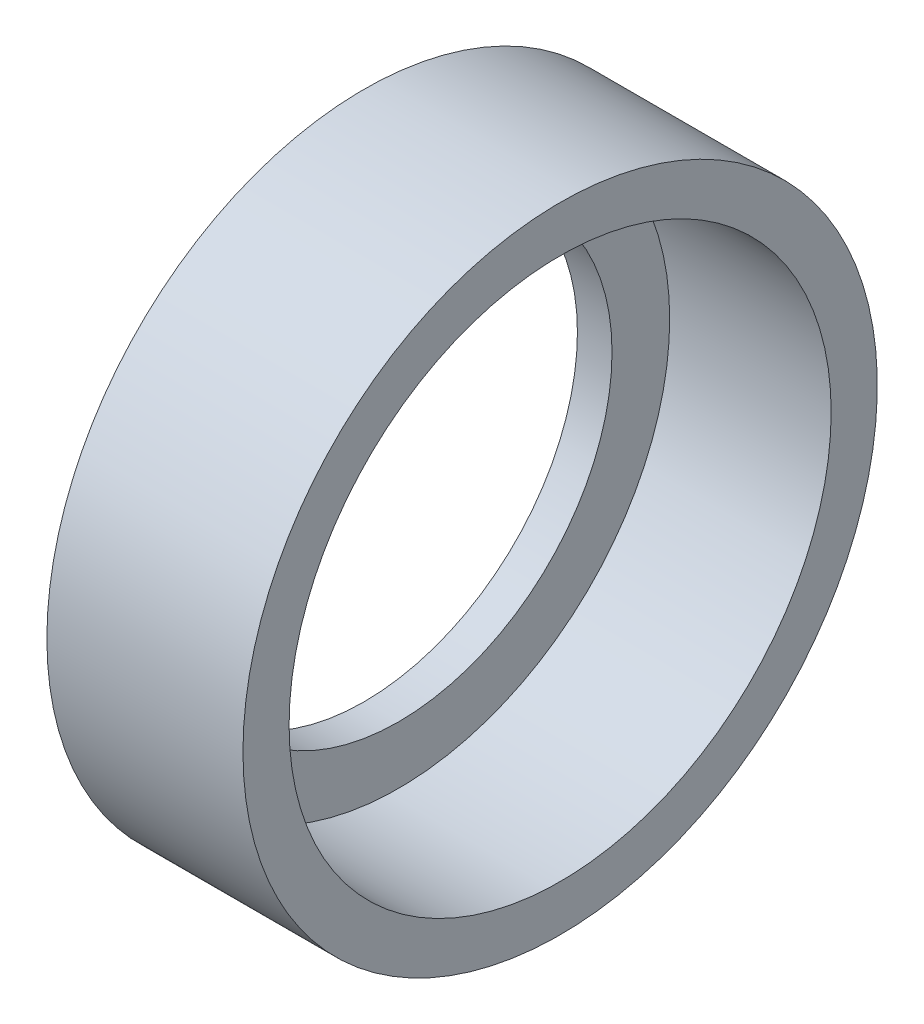
ISO-10303-21;
HEADER;
FILE_DESCRIPTION(('STEP AP214'),'2;1');
FILE_NAME('part.step','',(''),(''),'','','');
FILE_SCHEMA(('AUTOMOTIVE_DESIGN { 1 0 10303 214 1 1 1 1 }'));
ENDSEC;
DATA;
#1=APPLICATION_CONTEXT('core data for automotive mechanical design processes');
#2=APPLICATION_PROTOCOL_DEFINITION('international standard','automotive_design',2000,#1);
#3=PRODUCT_CONTEXT('',#1,'mechanical');
#4=PRODUCT('Part','Part','',(#3));
#5=PRODUCT_RELATED_PRODUCT_CATEGORY('part','',(#4));
#6=PRODUCT_DEFINITION_FORMATION('','',#4);
#7=PRODUCT_DEFINITION_CONTEXT('part definition',#1,'design');
#8=PRODUCT_DEFINITION('design','',#6,#7);
#9=PRODUCT_DEFINITION_SHAPE('','',#8);
#10=(LENGTH_UNIT() NAMED_UNIT(*) SI_UNIT(.MILLI.,.METRE.));
#11=(NAMED_UNIT(*) PLANE_ANGLE_UNIT() SI_UNIT($,.RADIAN.));
#12=(NAMED_UNIT(*) SI_UNIT($,.STERADIAN.) SOLID_ANGLE_UNIT());
#13=UNCERTAINTY_MEASURE_WITH_UNIT(LENGTH_MEASURE(1.E-05),#10,'distance_accuracy_value','');
#14=(GEOMETRIC_REPRESENTATION_CONTEXT(3) GLOBAL_UNCERTAINTY_ASSIGNED_CONTEXT((#13)) GLOBAL_UNIT_ASSIGNED_CONTEXT((#10,
#11,#12)) REPRESENTATION_CONTEXT('',''));
#15=CARTESIAN_POINT('',(0.,0.,0.));
#16=DIRECTION('',(0.,0.,1.));
#17=DIRECTION('',(1.,0.,0.));
#18=AXIS2_PLACEMENT_3D('',#15,#16,#17);
#19=CARTESIAN_POINT('',(3.18999384199548E-13,0.,-27.5));
#20=DIRECTION('',(-1.,0.,0.));
#21=DIRECTION('',(0.,0.,1.));
#22=AXIS2_PLACEMENT_3D('',#19,#20,#21);
#23=PLANE('',#22);
#24=CARTESIAN_POINT('',(2.22044604925031E-13,0.,0.));
#25=DIRECTION('',(-1.,0.,0.));
#26=DIRECTION('',(0.,0.,1.));
#27=AXIS2_PLACEMENT_3D('',#24,#25,#26);
#28=CIRCLE('',#27,27.5);
#29=CARTESIAN_POINT('',(2.22044604925031E-13,0.,27.5));
#30=VERTEX_POINT('',#29);
#31=EDGE_CURVE('E56',#30,#30,#28,.T.);
#32=ORIENTED_EDGE('',*,*,#31,.F.);
#33=EDGE_LOOP('',(#32));
#34=FACE_BOUND('',#33,.T.);
#35=CARTESIAN_POINT('',(2.22044604925031E-13,0.,0.));
#36=DIRECTION('',(-1.,0.,0.));
#37=DIRECTION('',(0.,0.,1.));
#38=AXIS2_PLACEMENT_3D('',#35,#36,#37);
#39=CIRCLE('',#38,23.4999999999994);
#40=CARTESIAN_POINT('',(2.22044604925031E-13,0.,23.4999999999994));
#41=VERTEX_POINT('',#40);
#42=EDGE_CURVE('E10',#41,#41,#39,.T.);
#43=ORIENTED_EDGE('',*,*,#42,.T.);
#44=EDGE_LOOP('',(#43));
#45=FACE_BOUND('',#44,.T.);
#46=ADVANCED_FACE('F34',(#34,#45),#23,.F.);
#47=CARTESIAN_POINT('',(-1000.,0.,0.));
#48=DIRECTION('',(-1.,0.,0.));
#49=DIRECTION('',(0.,0.,1.));
#50=AXIS2_PLACEMENT_3D('',#47,#48,#49);
#51=CYLINDRICAL_SURFACE('',#50,23.4999999999994);
#52=ORIENTED_EDGE('',*,*,#42,.F.);
#53=EDGE_LOOP('',(#52));
#54=FACE_BOUND('',#53,.T.);
#55=CARTESIAN_POINT('',(-13.9999999999996,0.,0.));
#56=DIRECTION('',(-1.,0.,0.));
#57=DIRECTION('',(0.,0.,1.));
#58=AXIS2_PLACEMENT_3D('',#55,#56,#57);
#59=CIRCLE('',#58,23.4999999999994);
#60=CARTESIAN_POINT('',(-13.9999999999996,0.,23.4999999999994));
#61=VERTEX_POINT('',#60);
#62=EDGE_CURVE('E40',#61,#61,#59,.T.);
#63=ORIENTED_EDGE('',*,*,#62,.T.);
#64=EDGE_LOOP('',(#63));
#65=FACE_BOUND('',#64,.T.);
#66=ADVANCED_FACE('F63',(#54,#65),#51,.F.);
#67=CARTESIAN_POINT('',(-13.9999999999996,0.,-23.4999999999994));
#68=DIRECTION('',(-1.,0.,0.));
#69=DIRECTION('',(0.,0.,1.));
#70=AXIS2_PLACEMENT_3D('',#67,#68,#69);
#71=PLANE('',#70);
#72=ORIENTED_EDGE('',*,*,#62,.F.);
#73=EDGE_LOOP('',(#72));
#74=FACE_BOUND('',#73,.T.);
#75=CARTESIAN_POINT('',(-13.9999999999996,0.,0.));
#76=DIRECTION('',(-1.,0.,0.));
#77=DIRECTION('',(0.,0.,1.));
#78=AXIS2_PLACEMENT_3D('',#75,#76,#77);
#79=CIRCLE('',#78,18.4999999999994);
#80=CARTESIAN_POINT('',(-13.9999999999996,0.,18.4999999999994));
#81=VERTEX_POINT('',#80);
#82=EDGE_CURVE('E44',#81,#81,#79,.T.);
#83=ORIENTED_EDGE('',*,*,#82,.T.);
#84=EDGE_LOOP('',(#83));
#85=FACE_BOUND('',#84,.T.);
#86=ADVANCED_FACE('F67',(#74,#85),#71,.F.);
#87=CARTESIAN_POINT('',(-1000.,0.,0.));
#88=DIRECTION('',(-1.,0.,0.));
#89=DIRECTION('',(0.,0.,1.));
#90=AXIS2_PLACEMENT_3D('',#87,#88,#89);
#91=CYLINDRICAL_SURFACE('',#90,18.4999999999994);
#92=ORIENTED_EDGE('',*,*,#82,.F.);
#93=EDGE_LOOP('',(#92));
#94=FACE_BOUND('',#93,.T.);
#95=CARTESIAN_POINT('',(-16.9999999999996,0.,0.));
#96=DIRECTION('',(-1.,0.,0.));
#97=DIRECTION('',(0.,0.,1.));
#98=AXIS2_PLACEMENT_3D('',#95,#96,#97);
#99=CIRCLE('',#98,18.4999999999994);
#100=CARTESIAN_POINT('',(-16.9999999999996,0.,18.4999999999994));
#101=VERTEX_POINT('',#100);
#102=EDGE_CURVE('E48',#101,#101,#99,.T.);
#103=ORIENTED_EDGE('',*,*,#102,.T.);
#104=EDGE_LOOP('',(#103));
#105=FACE_BOUND('',#104,.T.);
#106=ADVANCED_FACE('F72',(#94,#105),#91,.F.);
#107=CARTESIAN_POINT('',(-16.9999999999996,0.,-18.4999999999994));
#108=DIRECTION('',(1.,0.,0.));
#109=DIRECTION('',(0.,0.,-1.));
#110=AXIS2_PLACEMENT_3D('',#107,#108,#109);
#111=PLANE('',#110);
#112=ORIENTED_EDGE('',*,*,#102,.F.);
#113=EDGE_LOOP('',(#112));
#114=FACE_BOUND('',#113,.T.);
#115=CARTESIAN_POINT('',(-16.9999999999996,0.,0.));
#116=DIRECTION('',(-1.,0.,0.));
#117=DIRECTION('',(0.,0.,1.));
#118=AXIS2_PLACEMENT_3D('',#115,#116,#117);
#119=CIRCLE('',#118,27.5);
#120=CARTESIAN_POINT('',(-16.9999999999996,0.,27.5));
#121=VERTEX_POINT('',#120);
#122=EDGE_CURVE('E53',#121,#121,#119,.T.);
#123=ORIENTED_EDGE('',*,*,#122,.T.);
#124=EDGE_LOOP('',(#123));
#125=FACE_BOUND('',#124,.T.);
#126=ADVANCED_FACE('F78',(#114,#125),#111,.F.);
#127=CARTESIAN_POINT('',(-1000.,0.,0.));
#128=DIRECTION('',(-1.,0.,0.));
#129=DIRECTION('',(0.,0.,1.));
#130=AXIS2_PLACEMENT_3D('',#127,#128,#129);
#131=CYLINDRICAL_SURFACE('',#130,27.5);
#132=ORIENTED_EDGE('',*,*,#122,.F.);
#133=EDGE_LOOP('',(#132));
#134=FACE_BOUND('',#133,.T.);
#135=ORIENTED_EDGE('',*,*,#31,.T.);
#136=EDGE_LOOP('',(#135));
#137=FACE_BOUND('',#136,.T.);
#138=ADVANCED_FACE('F60',(#134,#137),#131,.T.);
#139=CLOSED_SHELL('',(#46,#66,#86,#106,#126,#138));
#140=MANIFOLD_SOLID_BREP('B2',#139);
#141=ADVANCED_BREP_SHAPE_REPRESENTATION('',(#18,#140),#14);
#142=SHAPE_DEFINITION_REPRESENTATION(#9,#141);
ENDSEC;
END-ISO-10303-21;
